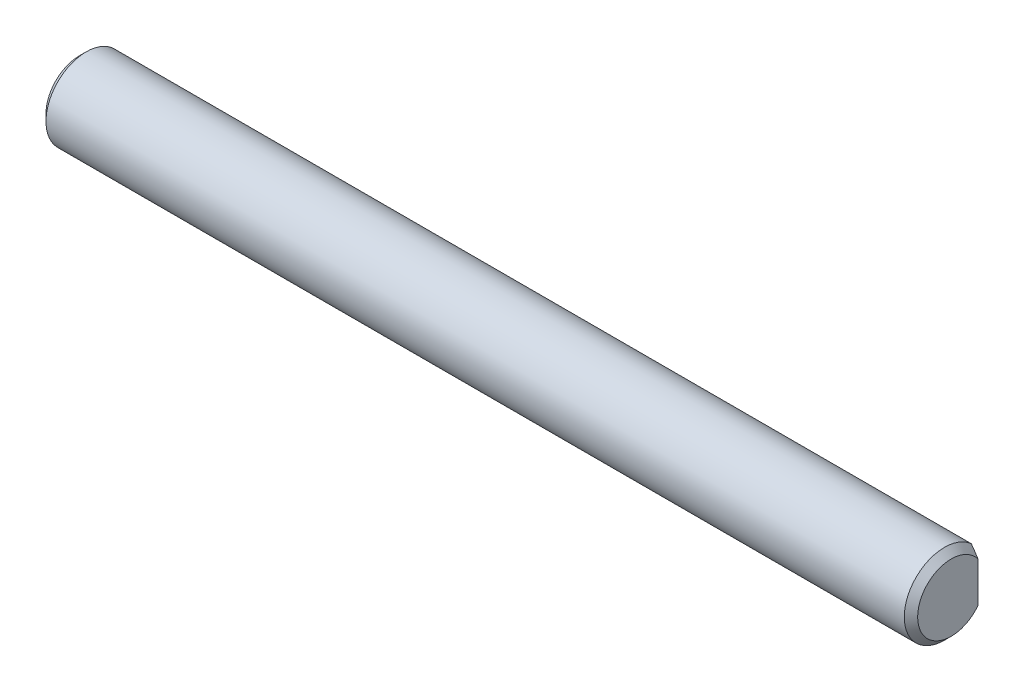
ISO-10303-21;
HEADER;
FILE_DESCRIPTION(('STEP AP214'),'2;1');
FILE_NAME('part.step','',(''),(''),'','','');
FILE_SCHEMA(('AUTOMOTIVE_DESIGN { 1 0 10303 214 1 1 1 1 }'));
ENDSEC;
DATA;
#1=APPLICATION_CONTEXT('core data for automotive mechanical design processes');
#2=APPLICATION_PROTOCOL_DEFINITION('international standard','automotive_design',2000,#1);
#3=PRODUCT_CONTEXT('',#1,'mechanical');
#4=PRODUCT('Part','Part','',(#3));
#5=PRODUCT_RELATED_PRODUCT_CATEGORY('part','',(#4));
#6=PRODUCT_DEFINITION_FORMATION('','',#4);
#7=PRODUCT_DEFINITION_CONTEXT('part definition',#1,'design');
#8=PRODUCT_DEFINITION('design','',#6,#7);
#9=PRODUCT_DEFINITION_SHAPE('','',#8);
#10=(LENGTH_UNIT() NAMED_UNIT(*) SI_UNIT(.MILLI.,.METRE.));
#11=(NAMED_UNIT(*) PLANE_ANGLE_UNIT() SI_UNIT($,.RADIAN.));
#12=(NAMED_UNIT(*) SI_UNIT($,.STERADIAN.) SOLID_ANGLE_UNIT());
#13=UNCERTAINTY_MEASURE_WITH_UNIT(LENGTH_MEASURE(1.E-05),#10,'distance_accuracy_value','');
#14=(GEOMETRIC_REPRESENTATION_CONTEXT(3) GLOBAL_UNCERTAINTY_ASSIGNED_CONTEXT((#13)) GLOBAL_UNIT_ASSIGNED_CONTEXT((#10,
#11,#12)) REPRESENTATION_CONTEXT('',''));
#15=CARTESIAN_POINT('',(0.,0.,0.));
#16=DIRECTION('',(0.,0.,1.));
#17=DIRECTION('',(1.,0.,0.));
#18=AXIS2_PLACEMENT_3D('',#15,#16,#17);
#19=CARTESIAN_POINT('',(65.,0.,0.));
#20=DIRECTION('',(-1.,0.,0.));
#21=DIRECTION('',(0.,0.,1.));
#22=AXIS2_PLACEMENT_3D('',#19,#20,#21);
#23=CYLINDRICAL_SURFACE('',#22,3.);
#24=CARTESIAN_POINT('',(64.5,0.,0.));
#25=DIRECTION('',(1.,0.,0.));
#26=DIRECTION('',(0.,0.,-1.));
#27=AXIS2_PLACEMENT_3D('',#24,#25,#26);
#28=CIRCLE('',#27,3.);
#29=CARTESIAN_POINT('',(64.5,-2.23606797749979,-2.));
#30=VERTEX_POINT('',#29);
#31=CARTESIAN_POINT('',(64.5,2.23606797749979,-2.));
#32=VERTEX_POINT('',#31);
#33=EDGE_CURVE('E100',#30,#32,#28,.F.);
#34=ORIENTED_EDGE('',*,*,#33,.T.);
#35=DIRECTION('',(-1.,0.,0.));
#36=VECTOR('',#35,1.);
#37=CARTESIAN_POINT('',(65.,2.23606797749979,-2.));
#38=LINE('',#37,#36);
#39=CARTESIAN_POINT('',(57.,2.23606797749979,-2.));
#40=VERTEX_POINT('',#39);
#41=EDGE_CURVE('E68',#32,#40,#38,.T.);
#42=ORIENTED_EDGE('',*,*,#41,.T.);
#43=CARTESIAN_POINT('',(57.,0.,0.));
#44=DIRECTION('',(-1.,0.,0.));
#45=DIRECTION('',(0.,0.,1.));
#46=AXIS2_PLACEMENT_3D('',#43,#44,#45);
#47=CIRCLE('',#46,3.);
#48=CARTESIAN_POINT('',(57.,-2.23606797749979,-2.));
#49=VERTEX_POINT('',#48);
#50=EDGE_CURVE('E11',#40,#49,#47,.T.);
#51=ORIENTED_EDGE('',*,*,#50,.T.);
#52=DIRECTION('',(-1.,0.,0.));
#53=VECTOR('',#52,1.);
#54=CARTESIAN_POINT('',(65.,-2.23606797749979,-2.));
#55=LINE('',#54,#53);
#56=EDGE_CURVE('E102',#49,#30,#55,.F.);
#57=ORIENTED_EDGE('',*,*,#56,.T.);
#58=EDGE_LOOP('',(#34,#42,#51,#57));
#59=FACE_BOUND('',#58,.T.);
#60=CARTESIAN_POINT('',(0.5,0.,0.));
#61=DIRECTION('',(1.,0.,0.));
#62=DIRECTION('',(0.,0.,-1.));
#63=AXIS2_PLACEMENT_3D('',#60,#61,#62);
#64=CIRCLE('',#63,3.);
#65=CARTESIAN_POINT('',(0.5,0.,-3.));
#66=VERTEX_POINT('',#65);
#67=EDGE_CURVE('E95',#66,#66,#64,.T.);
#68=ORIENTED_EDGE('',*,*,#67,.T.);
#69=EDGE_LOOP('',(#68));
#70=FACE_BOUND('',#69,.T.);
#71=ADVANCED_FACE('F45',(#59,#70),#23,.T.);
#72=CARTESIAN_POINT('',(65.,0.,0.));
#73=DIRECTION('',(1.,0.,0.));
#74=DIRECTION('',(0.,0.,-1.));
#75=AXIS2_PLACEMENT_3D('',#72,#73,#74);
#76=PLANE('',#75);
#77=DIRECTION('',(0.,-1.,0.));
#78=VECTOR('',#77,1.);
#79=CARTESIAN_POINT('',(65.,3.20055985861298,-2.));
#80=LINE('',#79,#78);
#81=CARTESIAN_POINT('',(65.,1.5,-2.));
#82=VERTEX_POINT('',#81);
#83=CARTESIAN_POINT('',(65.,-1.5,-2.));
#84=VERTEX_POINT('',#83);
#85=EDGE_CURVE('E62',#82,#84,#80,.T.);
#86=ORIENTED_EDGE('',*,*,#85,.F.);
#87=CARTESIAN_POINT('',(65.,0.,0.));
#88=DIRECTION('',(1.,0.,0.));
#89=DIRECTION('',(0.,0.,-1.));
#90=AXIS2_PLACEMENT_3D('',#87,#88,#89);
#91=CIRCLE('',#90,2.5);
#92=EDGE_CURVE('E89',#82,#84,#91,.T.);
#93=ORIENTED_EDGE('',*,*,#92,.T.);
#94=EDGE_LOOP('',(#86,#93));
#95=FACE_BOUND('',#94,.T.);
#96=ADVANCED_FACE('F88',(#95),#76,.T.);
#97=CARTESIAN_POINT('',(0.,0.,0.));
#98=DIRECTION('',(1.,0.,0.));
#99=DIRECTION('',(0.,0.,-1.));
#100=AXIS2_PLACEMENT_3D('',#97,#98,#99);
#101=PLANE('',#100);
#102=CARTESIAN_POINT('',(0.,0.,0.));
#103=DIRECTION('',(1.,0.,0.));
#104=DIRECTION('',(0.,0.,-1.));
#105=AXIS2_PLACEMENT_3D('',#102,#103,#104);
#106=CIRCLE('',#105,2.5);
#107=CARTESIAN_POINT('',(0.,0.,-2.5));
#108=VERTEX_POINT('',#107);
#109=EDGE_CURVE('E108',#108,#108,#106,.F.);
#110=ORIENTED_EDGE('',*,*,#109,.T.);
#111=EDGE_LOOP('',(#110));
#112=FACE_BOUND('',#111,.T.);
#113=ADVANCED_FACE('F127',(#112),#101,.F.);
#114=CARTESIAN_POINT('',(65.,0.,0.));
#115=DIRECTION('',(-1.,0.,0.));
#116=DIRECTION('',(0.,0.,1.));
#117=AXIS2_PLACEMENT_3D('',#114,#115,#116);
#118=CONICAL_SURFACE('',#117,2.5,0.785398163397447);
#119=CARTESIAN_POINT('',(64.4993,2.23700703843328,-2.));
#120=CARTESIAN_POINT('',(64.5421196966925,2.17955375500451,-2.));
#121=CARTESIAN_POINT('',(64.5844853414993,2.12175595723195,-2.));
#122=CARTESIAN_POINT('',(64.6680955253897,2.00532857151727,-2.));
#123=CARTESIAN_POINT('',(64.7093397081309,1.94669872799592,-2.));
#124=CARTESIAN_POINT('',(64.7908678591453,1.82791607476459,-2.));
#125=CARTESIAN_POINT('',(64.8311383008669,1.76775393847623,-2.));
#126=CARTESIAN_POINT('',(64.9099699549312,1.64632608074997,-2.));
#127=CARTESIAN_POINT('',(64.9485313138046,1.58506045455727,-2.));
#128=CARTESIAN_POINT('',(65.0255570041114,1.45793072930445,-2.));
#129=CARTESIAN_POINT('',(65.0639060196359,1.39199585503252,-2.));
#130=CARTESIAN_POINT('',(65.1376453137932,1.25849647756776,-2.));
#131=CARTESIAN_POINT('',(65.1730349587288,1.19093162931532,-2.));
#132=CARTESIAN_POINT('',(65.2733588485032,0.98596397106268,-2.));
#133=CARTESIAN_POINT('',(65.332835727171,0.845675225829995,-2.));
#134=CARTESIAN_POINT('',(65.4029853449663,0.63367294219822,-2.));
#135=CARTESIAN_POINT('',(65.4228234766131,0.564986427364833,-2.));
#136=CARTESIAN_POINT('',(65.456231615327,0.426067021922664,-2.));
#137=CARTESIAN_POINT('',(65.469801427191,0.355834083227679,-2.));
#138=CARTESIAN_POINT('',(65.4895798997712,0.215656238630627,-2.));
#139=CARTESIAN_POINT('',(65.4959209933784,0.145730344407531,-2.));
#140=CARTESIAN_POINT('',(65.5012175097349,0.00559765577096344,-2.));
#141=CARTESIAN_POINT('',(65.5001735150359,-0.0646091160496458,-2.));
#142=CARTESIAN_POINT('',(65.4907870969848,-0.204457441049221,-2.));
#143=CARTESIAN_POINT('',(65.4824513352225,-0.27409945158623,-2.));
#144=CARTESIAN_POINT('',(65.4590924177858,-0.412243838195294,-2.));
#145=CARTESIAN_POINT('',(65.4440679032801,-0.480745979766179,-2.));
#146=CARTESIAN_POINT('',(65.4079170203283,-0.617448335458616,-2.));
#147=CARTESIAN_POINT('',(65.3866832608536,-0.685619698346205,-2.));
#148=CARTESIAN_POINT('',(65.3392711597889,-0.820190919096159,-2.));
#149=CARTESIAN_POINT('',(65.3130929068996,-0.88659080871316,-2.));
#150=CARTESIAN_POINT('',(65.2340359991916,-1.07054353362759,-2.));
#151=CARTESIAN_POINT('',(65.1766536828156,-1.18615194105933,-2.));
#152=CARTESIAN_POINT('',(65.0532023635591,-1.4127465444243,-2.));
#153=CARTESIAN_POINT('',(64.9871180679938,-1.5237241392913,-2.));
#154=CARTESIAN_POINT('',(64.8524591934658,-1.73664107383193,-2.));
#155=CARTESIAN_POINT('',(64.78416204637,-1.83875748602179,-2.));
#156=CARTESIAN_POINT('',(64.6790498166038,-1.98973581965622,-2.));
#157=CARTESIAN_POINT('',(64.643645516368,-2.03959293596968,-2.));
#158=CARTESIAN_POINT('',(64.5720399765084,-2.13871944100795,-2.));
#159=CARTESIAN_POINT('',(64.5358388703341,-2.18798892605012,-2.));
#160=CARTESIAN_POINT('',(64.4993,-2.23700703843328,-2.));
#161=B_SPLINE_CURVE_WITH_KNOTS('',3,(#119,#120,#121,#122,#123,#124,#125,#126,#127,#128,#129,
#130,#131,#132,#133,#134,#135,#136,#137,#138,#139,#140,#141,#142,#143,#144,#145,#146,#147,#148,
#149,#150,#151,#152,#153,#154,#155,#156,#157,#158,#159,#160),.UNSPECIFIED.,.F.,.F.,(4,2,2,2,2,2,
2,2,2,2,2,2,2,2,2,2,2,2,2,2,4),(0.,0.214969205468668,0.430005937146426,0.647168879660774,
0.864313167232138,1.09306195118813,1.32185959290741,1.7772861314431,1.99153696336322,
2.2057944668692,2.41606021515297,2.6263093774059,2.83636666125514,3.04646663808104,
3.26044016474782,3.47440985324051,3.86098427284734,4.24824735060584,4.61667573350208,
4.80011706932151,4.9835279126273),.UNSPECIFIED.);
#162=EDGE_CURVE('E55',#32,#82,#161,.T.);
#163=ORIENTED_EDGE('',*,*,#162,.F.);
#164=ORIENTED_EDGE('',*,*,#33,.F.);
#165=EDGE_CURVE('E85',#84,#30,#161,.T.);
#166=ORIENTED_EDGE('',*,*,#165,.F.);
#167=ORIENTED_EDGE('',*,*,#92,.F.);
#168=EDGE_LOOP('',(#163,#164,#166,#167));
#169=FACE_BOUND('',#168,.T.);
#170=ADVANCED_FACE('F93',(#169),#118,.T.);
#171=CARTESIAN_POINT('',(0.5,0.,0.));
#172=DIRECTION('',(1.,0.,0.));
#173=DIRECTION('',(0.,0.,-1.));
#174=AXIS2_PLACEMENT_3D('',#171,#172,#173);
#175=CONICAL_SURFACE('',#174,3.,0.785398163397447);
#176=ORIENTED_EDGE('',*,*,#109,.F.);
#177=EDGE_LOOP('',(#176));
#178=FACE_BOUND('',#177,.T.);
#179=ORIENTED_EDGE('',*,*,#67,.F.);
#180=EDGE_LOOP('',(#179));
#181=FACE_BOUND('',#180,.T.);
#182=ADVANCED_FACE('F48',(#178,#181),#175,.T.);
#183=CARTESIAN_POINT('',(57.,0.,-2.68603476272151));
#184=DIRECTION('',(-1.,0.,0.));
#185=DIRECTION('',(0.,0.,1.));
#186=AXIS2_PLACEMENT_3D('',#183,#184,#185);
#187=PLANE('',#186);
#188=DIRECTION('',(0.,-1.,0.));
#189=VECTOR('',#188,1.);
#190=CARTESIAN_POINT('',(57.,3.20055985861298,-2.));
#191=LINE('',#190,#189);
#192=EDGE_CURVE('E91',#40,#49,#191,.T.);
#193=ORIENTED_EDGE('',*,*,#192,.T.);
#194=ORIENTED_EDGE('',*,*,#50,.F.);
#195=EDGE_LOOP('',(#193,#194));
#196=FACE_BOUND('',#195,.T.);
#197=ADVANCED_FACE('F124',(#196),#187,.F.);
#198=CARTESIAN_POINT('',(57.,3.20055985861298,-2.));
#199=DIRECTION('',(0.,0.,1.));
#200=DIRECTION('',(0.,-1.,0.));
#201=AXIS2_PLACEMENT_3D('',#198,#199,#200);
#202=PLANE('',#201);
#203=ORIENTED_EDGE('',*,*,#162,.T.);
#204=ORIENTED_EDGE('',*,*,#85,.T.);
#205=ORIENTED_EDGE('',*,*,#165,.T.);
#206=ORIENTED_EDGE('',*,*,#56,.F.);
#207=ORIENTED_EDGE('',*,*,#192,.F.);
#208=ORIENTED_EDGE('',*,*,#41,.F.);
#209=EDGE_LOOP('',(#203,#204,#205,#206,#207,#208));
#210=FACE_BOUND('',#209,.T.);
#211=ADVANCED_FACE('F79',(#210),#202,.F.);
#212=CLOSED_SHELL('',(#71,#96,#113,#170,#182,#197,#211));
#213=MANIFOLD_SOLID_BREP('B2',#212);
#214=ADVANCED_BREP_SHAPE_REPRESENTATION('',(#18,#213),#14);
#215=SHAPE_DEFINITION_REPRESENTATION(#9,#214);
ENDSEC;
END-ISO-10303-21;
